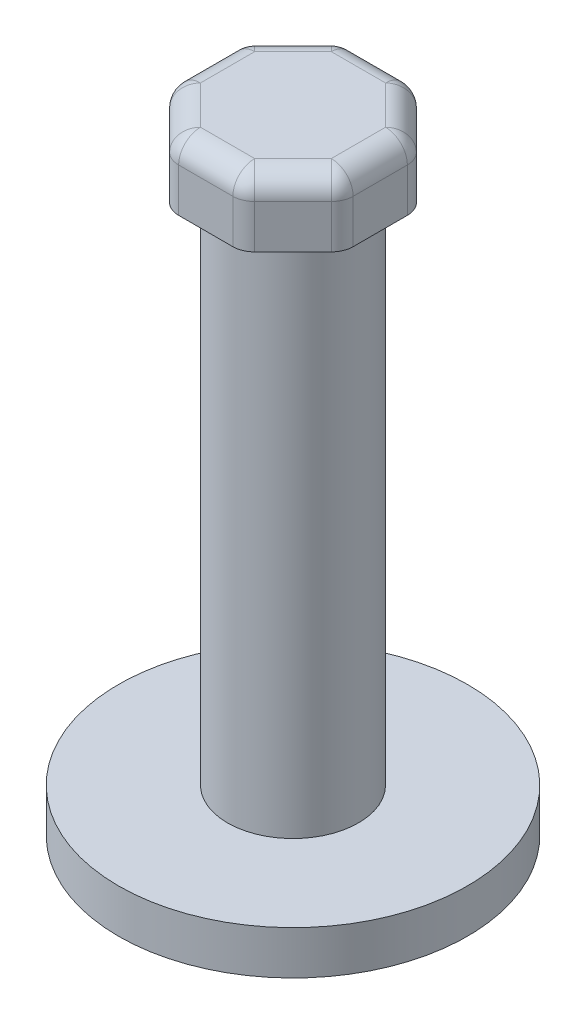
ISO-10303-21;
HEADER;
FILE_DESCRIPTION(('STEP AP214'),'2;1');
FILE_NAME('part.step','',(''),(''),'','','');
FILE_SCHEMA(('AUTOMOTIVE_DESIGN { 1 0 10303 214 1 1 1 1 }'));
ENDSEC;
DATA;
#1=APPLICATION_CONTEXT('core data for automotive mechanical design processes');
#2=APPLICATION_PROTOCOL_DEFINITION('international standard','automotive_design',2000,#1);
#3=PRODUCT_CONTEXT('',#1,'mechanical');
#4=PRODUCT('Part','Part','',(#3));
#5=PRODUCT_RELATED_PRODUCT_CATEGORY('part','',(#4));
#6=PRODUCT_DEFINITION_FORMATION('','',#4);
#7=PRODUCT_DEFINITION_CONTEXT('part definition',#1,'design');
#8=PRODUCT_DEFINITION('design','',#6,#7);
#9=PRODUCT_DEFINITION_SHAPE('','',#8);
#10=(LENGTH_UNIT() NAMED_UNIT(*) SI_UNIT(.MILLI.,.METRE.));
#11=(NAMED_UNIT(*) PLANE_ANGLE_UNIT() SI_UNIT($,.RADIAN.));
#12=(NAMED_UNIT(*) SI_UNIT($,.STERADIAN.) SOLID_ANGLE_UNIT());
#13=UNCERTAINTY_MEASURE_WITH_UNIT(LENGTH_MEASURE(1.E-05),#10,'distance_accuracy_value','');
#14=(GEOMETRIC_REPRESENTATION_CONTEXT(3) GLOBAL_UNCERTAINTY_ASSIGNED_CONTEXT((#13)) GLOBAL_UNIT_ASSIGNED_CONTEXT((#10,
#11,#12)) REPRESENTATION_CONTEXT('',''));
#15=CARTESIAN_POINT('',(0.,0.,0.));
#16=DIRECTION('',(0.,0.,1.));
#17=DIRECTION('',(1.,0.,0.));
#18=AXIS2_PLACEMENT_3D('',#15,#16,#17);
#19=CARTESIAN_POINT('',(0.,2.54,0.));
#20=DIRECTION('',(0.,-1.,0.));
#21=DIRECTION('',(0.,0.,-1.));
#22=AXIS2_PLACEMENT_3D('',#19,#20,#21);
#23=CYLINDRICAL_SURFACE('',#22,10.16);
#24=CARTESIAN_POINT('',(0.,2.54,0.));
#25=DIRECTION('',(0.,1.,0.));
#26=DIRECTION('',(0.,0.,1.));
#27=AXIS2_PLACEMENT_3D('',#24,#25,#26);
#28=CIRCLE('',#27,10.16);
#29=CARTESIAN_POINT('',(0.,2.54,10.16));
#30=VERTEX_POINT('',#29);
#31=EDGE_CURVE('E208',#30,#30,#28,.T.);
#32=ORIENTED_EDGE('',*,*,#31,.F.);
#33=EDGE_LOOP('',(#32));
#34=FACE_BOUND('',#33,.T.);
#35=CARTESIAN_POINT('',(0.,0.,0.));
#36=DIRECTION('',(0.,1.,0.));
#37=DIRECTION('',(0.,0.,1.));
#38=AXIS2_PLACEMENT_3D('',#35,#36,#37);
#39=CIRCLE('',#38,10.16);
#40=CARTESIAN_POINT('',(0.,0.,10.16));
#41=VERTEX_POINT('',#40);
#42=EDGE_CURVE('E211',#41,#41,#39,.T.);
#43=ORIENTED_EDGE('',*,*,#42,.T.);
#44=EDGE_LOOP('',(#43));
#45=FACE_BOUND('',#44,.T.);
#46=ADVANCED_FACE('F33',(#34,#45),#23,.T.);
#47=CARTESIAN_POINT('',(0.,2.54,0.));
#48=DIRECTION('',(0.,1.,0.));
#49=DIRECTION('',(0.,0.,1.));
#50=AXIS2_PLACEMENT_3D('',#47,#48,#49);
#51=PLANE('',#50);
#52=CARTESIAN_POINT('',(0.,2.54,0.));
#53=DIRECTION('',(0.,1.,0.));
#54=DIRECTION('',(0.,0.,1.));
#55=AXIS2_PLACEMENT_3D('',#52,#53,#54);
#56=CIRCLE('',#55,3.81);
#57=CARTESIAN_POINT('',(0.,2.54,3.81));
#58=VERTEX_POINT('',#57);
#59=EDGE_CURVE('E204',#58,#58,#56,.T.);
#60=ORIENTED_EDGE('',*,*,#59,.F.);
#61=EDGE_LOOP('',(#60));
#62=FACE_BOUND('',#61,.T.);
#63=ORIENTED_EDGE('',*,*,#31,.T.);
#64=EDGE_LOOP('',(#63));
#65=FACE_BOUND('',#64,.T.);
#66=ADVANCED_FACE('F399',(#62,#65),#51,.T.);
#67=CARTESIAN_POINT('',(0.,0.,0.));
#68=DIRECTION('',(0.,1.,0.));
#69=DIRECTION('',(0.,0.,1.));
#70=AXIS2_PLACEMENT_3D('',#67,#68,#69);
#71=PLANE('',#70);
#72=ORIENTED_EDGE('',*,*,#42,.F.);
#73=EDGE_LOOP('',(#72));
#74=FACE_BOUND('',#73,.T.);
#75=ADVANCED_FACE('F396',(#74),#71,.F.);
#76=CARTESIAN_POINT('',(0.,33.02,0.));
#77=DIRECTION('',(0.,-1.,0.));
#78=DIRECTION('',(0.,0.,-1.));
#79=AXIS2_PLACEMENT_3D('',#76,#77,#78);
#80=CYLINDRICAL_SURFACE('',#79,3.81);
#81=CARTESIAN_POINT('',(0.,33.02,0.));
#82=DIRECTION('',(0.,1.,0.));
#83=DIRECTION('',(0.,0.,1.));
#84=AXIS2_PLACEMENT_3D('',#81,#82,#83);
#85=CIRCLE('',#84,3.81);
#86=CARTESIAN_POINT('',(0.,33.02,3.81));
#87=VERTEX_POINT('',#86);
#88=EDGE_CURVE('E387',#87,#87,#85,.T.);
#89=ORIENTED_EDGE('',*,*,#88,.F.);
#90=EDGE_LOOP('',(#89));
#91=FACE_BOUND('',#90,.T.);
#92=ORIENTED_EDGE('',*,*,#59,.T.);
#93=EDGE_LOOP('',(#92));
#94=FACE_BOUND('',#93,.T.);
#95=ADVANCED_FACE('F398',(#91,#94),#80,.T.);
#96=CARTESIAN_POINT('',(5.08,36.83,-2.10420489685532));
#97=DIRECTION('',(-0.707106781186547,0.,0.707106781186548));
#98=DIRECTION('',(0.707106781186548,0.,0.707106781186547));
#99=AXIS2_PLACEMENT_3D('',#96,#97,#98);
#100=PLANE('',#99);
#101=DIRECTION('',(-0.707106781186548,0.,-0.707106781186547));
#102=VECTOR('',#101,1.);
#103=CARTESIAN_POINT('',(5.08,35.56,-2.10420489685532));
#104=LINE('',#103,#102);
#105=CARTESIAN_POINT('',(2.4761792847484,35.56,-4.70802561210692));
#106=VERTEX_POINT('',#105);
#107=CARTESIAN_POINT('',(4.70802561210692,35.56,-2.47617928474841));
#108=VERTEX_POINT('',#107);
#109=EDGE_CURVE('E232',#106,#108,#104,.F.);
#110=ORIENTED_EDGE('',*,*,#109,.T.);
#111=DIRECTION('',(0.,-1.,0.));
#112=VECTOR('',#111,1.);
#113=CARTESIAN_POINT('',(4.70802561210692,36.83,-2.47617928474841));
#114=LINE('',#113,#112);
#115=CARTESIAN_POINT('',(4.70802561210692,33.02,-2.47617928474841));
#116=VERTEX_POINT('',#115);
#117=EDGE_CURVE('E234',#108,#116,#114,.T.);
#118=ORIENTED_EDGE('',*,*,#117,.T.);
#119=DIRECTION('',(-0.707106781186548,0.,-0.707106781186547));
#120=VECTOR('',#119,1.);
#121=CARTESIAN_POINT('',(5.08,33.02,-2.10420489685532));
#122=LINE('',#121,#120);
#123=CARTESIAN_POINT('',(2.4761792847484,33.02,-4.70802561210692));
#124=VERTEX_POINT('',#123);
#125=EDGE_CURVE('E367',#116,#124,#122,.T.);
#126=ORIENTED_EDGE('',*,*,#125,.T.);
#127=DIRECTION('',(0.,-1.,0.));
#128=VECTOR('',#127,1.);
#129=CARTESIAN_POINT('',(2.4761792847484,36.83,-4.70802561210692));
#130=LINE('',#129,#128);
#131=EDGE_CURVE('E230',#124,#106,#130,.F.);
#132=ORIENTED_EDGE('',*,*,#131,.T.);
#133=EDGE_LOOP('',(#110,#118,#126,#132));
#134=FACE_BOUND('',#133,.T.);
#135=ADVANCED_FACE('F405',(#134),#100,.F.);
#136=CARTESIAN_POINT('',(2.10420489685532,36.83,-5.08));
#137=DIRECTION('',(0.,0.,1.));
#138=DIRECTION('',(1.,0.,0.));
#139=AXIS2_PLACEMENT_3D('',#136,#137,#138);
#140=PLANE('',#139);
#141=DIRECTION('',(-1.,0.,0.));
#142=VECTOR('',#141,1.);
#143=CARTESIAN_POINT('',(2.10420489685532,35.56,-5.08));
#144=LINE('',#143,#142);
#145=CARTESIAN_POINT('',(-1.57815367264149,35.56,-5.08));
#146=VERTEX_POINT('',#145);
#147=CARTESIAN_POINT('',(1.57815367264149,35.56,-5.08));
#148=VERTEX_POINT('',#147);
#149=EDGE_CURVE('E238',#146,#148,#144,.F.);
#150=ORIENTED_EDGE('',*,*,#149,.T.);
#151=DIRECTION('',(0.,-1.,0.));
#152=VECTOR('',#151,1.);
#153=CARTESIAN_POINT('',(1.57815367264149,36.83,-5.08));
#154=LINE('',#153,#152);
#155=CARTESIAN_POINT('',(1.57815367264149,33.02,-5.08));
#156=VERTEX_POINT('',#155);
#157=EDGE_CURVE('E240',#148,#156,#154,.T.);
#158=ORIENTED_EDGE('',*,*,#157,.T.);
#159=DIRECTION('',(-1.,0.,0.));
#160=VECTOR('',#159,1.);
#161=CARTESIAN_POINT('',(2.10420489685532,33.02,-5.08));
#162=LINE('',#161,#160);
#163=CARTESIAN_POINT('',(-1.57815367264149,33.02,-5.08));
#164=VERTEX_POINT('',#163);
#165=EDGE_CURVE('E361',#156,#164,#162,.T.);
#166=ORIENTED_EDGE('',*,*,#165,.T.);
#167=DIRECTION('',(0.,-1.,0.));
#168=VECTOR('',#167,1.);
#169=CARTESIAN_POINT('',(-1.57815367264149,36.83,-5.08));
#170=LINE('',#169,#168);
#171=EDGE_CURVE('E236',#164,#146,#170,.F.);
#172=ORIENTED_EDGE('',*,*,#171,.T.);
#173=EDGE_LOOP('',(#150,#158,#166,#172));
#174=FACE_BOUND('',#173,.T.);
#175=ADVANCED_FACE('F365',(#174),#140,.F.);
#176=CARTESIAN_POINT('',(-2.10420489685532,36.83,-5.08));
#177=DIRECTION('',(0.707106781186548,0.,0.707106781186547));
#178=DIRECTION('',(0.707106781186547,0.,-0.707106781186548));
#179=AXIS2_PLACEMENT_3D('',#176,#177,#178);
#180=PLANE('',#179);
#181=DIRECTION('',(-0.707106781186547,0.,0.707106781186548));
#182=VECTOR('',#181,1.);
#183=CARTESIAN_POINT('',(-2.10420489685532,33.02,-5.08));
#184=LINE('',#183,#182);
#185=CARTESIAN_POINT('',(-2.47617928474841,33.02,-4.70802561210691));
#186=VERTEX_POINT('',#185);
#187=CARTESIAN_POINT('',(-4.70802561210692,33.02,-2.4761792847484));
#188=VERTEX_POINT('',#187);
#189=EDGE_CURVE('E363',#186,#188,#184,.T.);
#190=ORIENTED_EDGE('',*,*,#189,.T.);
#191=DIRECTION('',(0.,-1.,0.));
#192=VECTOR('',#191,1.);
#193=CARTESIAN_POINT('',(-4.70802561210692,36.83,-2.4761792847484));
#194=LINE('',#193,#192);
#195=CARTESIAN_POINT('',(-4.70802561210692,35.56,-2.4761792847484));
#196=VERTEX_POINT('',#195);
#197=EDGE_CURVE('E246',#188,#196,#194,.F.);
#198=ORIENTED_EDGE('',*,*,#197,.T.);
#199=DIRECTION('',(-0.707106781186547,0.,0.707106781186548));
#200=VECTOR('',#199,1.);
#201=CARTESIAN_POINT('',(-2.10420489685532,35.56,-5.08));
#202=LINE('',#201,#200);
#203=CARTESIAN_POINT('',(-2.47617928474841,35.56,-4.70802561210691));
#204=VERTEX_POINT('',#203);
#205=EDGE_CURVE('E244',#196,#204,#202,.F.);
#206=ORIENTED_EDGE('',*,*,#205,.T.);
#207=DIRECTION('',(0.,-1.,0.));
#208=VECTOR('',#207,1.);
#209=CARTESIAN_POINT('',(-2.47617928474841,36.83,-4.70802561210691));
#210=LINE('',#209,#208);
#211=EDGE_CURVE('E242',#204,#186,#210,.T.);
#212=ORIENTED_EDGE('',*,*,#211,.T.);
#213=EDGE_LOOP('',(#190,#198,#206,#212));
#214=FACE_BOUND('',#213,.T.);
#215=ADVANCED_FACE('F347',(#214),#180,.F.);
#216=CARTESIAN_POINT('',(-5.08,36.83,-2.10420489685532));
#217=DIRECTION('',(1.,0.,0.));
#218=DIRECTION('',(0.,0.,-1.));
#219=AXIS2_PLACEMENT_3D('',#216,#217,#218);
#220=PLANE('',#219);
#221=DIRECTION('',(0.,0.,1.));
#222=VECTOR('',#221,1.);
#223=CARTESIAN_POINT('',(-5.08,33.02,-2.10420489685532));
#224=LINE('',#223,#222);
#225=CARTESIAN_POINT('',(-5.08,33.02,-1.57815367264149));
#226=VERTEX_POINT('',#225);
#227=CARTESIAN_POINT('',(-5.08,33.02,1.57815367264149));
#228=VERTEX_POINT('',#227);
#229=EDGE_CURVE('E369',#226,#228,#224,.T.);
#230=ORIENTED_EDGE('',*,*,#229,.T.);
#231=DIRECTION('',(0.,-1.,0.));
#232=VECTOR('',#231,1.);
#233=CARTESIAN_POINT('',(-5.08,36.83,1.57815367264149));
#234=LINE('',#233,#232);
#235=CARTESIAN_POINT('',(-5.08,35.56,1.57815367264149));
#236=VERTEX_POINT('',#235);
#237=EDGE_CURVE('E251',#228,#236,#234,.F.);
#238=ORIENTED_EDGE('',*,*,#237,.T.);
#239=DIRECTION('',(0.,0.,1.));
#240=VECTOR('',#239,1.);
#241=CARTESIAN_POINT('',(-5.08,35.56,-2.10420489685532));
#242=LINE('',#241,#240);
#243=CARTESIAN_POINT('',(-5.08,35.56,-1.57815367264149));
#244=VERTEX_POINT('',#243);
#245=EDGE_CURVE('E187',#236,#244,#242,.F.);
#246=ORIENTED_EDGE('',*,*,#245,.T.);
#247=DIRECTION('',(0.,-1.,0.));
#248=VECTOR('',#247,1.);
#249=CARTESIAN_POINT('',(-5.08,36.83,-1.57815367264149));
#250=LINE('',#249,#248);
#251=EDGE_CURVE('E248',#244,#226,#250,.T.);
#252=ORIENTED_EDGE('',*,*,#251,.T.);
#253=EDGE_LOOP('',(#230,#238,#246,#252));
#254=FACE_BOUND('',#253,.T.);
#255=ADVANCED_FACE('F510',(#254),#220,.F.);
#256=CARTESIAN_POINT('',(-5.08,36.83,2.10420489685532));
#257=DIRECTION('',(0.707106781186547,0.,-0.707106781186548));
#258=DIRECTION('',(-0.707106781186548,0.,-0.707106781186547));
#259=AXIS2_PLACEMENT_3D('',#256,#257,#258);
#260=PLANE('',#259);
#261=DIRECTION('',(0.707106781186548,0.,0.707106781186547));
#262=VECTOR('',#261,1.);
#263=CARTESIAN_POINT('',(-5.08,33.02,2.10420489685532));
#264=LINE('',#263,#262);
#265=CARTESIAN_POINT('',(-4.70802561210691,33.02,2.47617928474841));
#266=VERTEX_POINT('',#265);
#267=CARTESIAN_POINT('',(-2.4761792847484,33.02,4.70802561210692));
#268=VERTEX_POINT('',#267);
#269=EDGE_CURVE('E376',#266,#268,#264,.T.);
#270=ORIENTED_EDGE('',*,*,#269,.T.);
#271=DIRECTION('',(0.,-1.,0.));
#272=VECTOR('',#271,1.);
#273=CARTESIAN_POINT('',(-2.4761792847484,36.83,4.70802561210691));
#274=LINE('',#273,#272);
#275=CARTESIAN_POINT('',(-2.4761792847484,35.56,4.70802561210692));
#276=VERTEX_POINT('',#275);
#277=EDGE_CURVE('E50',#268,#276,#274,.F.);
#278=ORIENTED_EDGE('',*,*,#277,.T.);
#279=DIRECTION('',(0.707106781186548,0.,0.707106781186547));
#280=VECTOR('',#279,1.);
#281=CARTESIAN_POINT('',(-5.08,35.56,2.10420489685532));
#282=LINE('',#281,#280);
#283=CARTESIAN_POINT('',(-4.70802561210691,35.56,2.47617928474841));
#284=VERTEX_POINT('',#283);
#285=EDGE_CURVE('E54',#276,#284,#282,.F.);
#286=ORIENTED_EDGE('',*,*,#285,.T.);
#287=DIRECTION('',(0.,-1.,0.));
#288=VECTOR('',#287,1.);
#289=CARTESIAN_POINT('',(-4.70802561210691,36.83,2.47617928474841));
#290=LINE('',#289,#288);
#291=EDGE_CURVE('E265',#284,#266,#290,.T.);
#292=ORIENTED_EDGE('',*,*,#291,.T.);
#293=EDGE_LOOP('',(#270,#278,#286,#292));
#294=FACE_BOUND('',#293,.T.);
#295=ADVANCED_FACE('F513',(#294),#260,.F.);
#296=CARTESIAN_POINT('',(-2.10420489685532,36.83,5.08));
#297=DIRECTION('',(0.,0.,-1.));
#298=DIRECTION('',(-1.,0.,0.));
#299=AXIS2_PLACEMENT_3D('',#296,#297,#298);
#300=PLANE('',#299);
#301=DIRECTION('',(1.,0.,0.));
#302=VECTOR('',#301,1.);
#303=CARTESIAN_POINT('',(-2.10420489685532,33.02,5.08));
#304=LINE('',#303,#302);
#305=CARTESIAN_POINT('',(-1.57815367264149,33.02,5.08));
#306=VERTEX_POINT('',#305);
#307=CARTESIAN_POINT('',(1.57815367264149,33.02,5.08));
#308=VERTEX_POINT('',#307);
#309=EDGE_CURVE('E378',#306,#308,#304,.T.);
#310=ORIENTED_EDGE('',*,*,#309,.T.);
#311=DIRECTION('',(0.,-1.,0.));
#312=VECTOR('',#311,1.);
#313=CARTESIAN_POINT('',(1.57815367264149,36.83,5.08));
#314=LINE('',#313,#312);
#315=CARTESIAN_POINT('',(1.57815367264149,35.56,5.08));
#316=VERTEX_POINT('',#315);
#317=EDGE_CURVE('E263',#308,#316,#314,.F.);
#318=ORIENTED_EDGE('',*,*,#317,.T.);
#319=DIRECTION('',(1.,0.,0.));
#320=VECTOR('',#319,1.);
#321=CARTESIAN_POINT('',(-2.10420489685532,35.56,5.08));
#322=LINE('',#321,#320);
#323=CARTESIAN_POINT('',(-1.57815367264149,35.56,5.08));
#324=VERTEX_POINT('',#323);
#325=EDGE_CURVE('E261',#316,#324,#322,.F.);
#326=ORIENTED_EDGE('',*,*,#325,.T.);
#327=DIRECTION('',(0.,-1.,0.));
#328=VECTOR('',#327,1.);
#329=CARTESIAN_POINT('',(-1.57815367264149,36.83,5.08));
#330=LINE('',#329,#328);
#331=EDGE_CURVE('E259',#324,#306,#330,.T.);
#332=ORIENTED_EDGE('',*,*,#331,.T.);
#333=EDGE_LOOP('',(#310,#318,#326,#332));
#334=FACE_BOUND('',#333,.T.);
#335=ADVANCED_FACE('F519',(#334),#300,.F.);
#336=CARTESIAN_POINT('',(2.10420489685532,36.83,5.08));
#337=DIRECTION('',(-0.707106781186548,0.,-0.707106781186547));
#338=DIRECTION('',(-0.707106781186547,0.,0.707106781186548));
#339=AXIS2_PLACEMENT_3D('',#336,#337,#338);
#340=PLANE('',#339);
#341=DIRECTION('',(0.707106781186547,0.,-0.707106781186548));
#342=VECTOR('',#341,1.);
#343=CARTESIAN_POINT('',(2.10420489685532,33.02,5.08));
#344=LINE('',#343,#342);
#345=CARTESIAN_POINT('',(2.47617928474841,33.02,4.70802561210691));
#346=VERTEX_POINT('',#345);
#347=CARTESIAN_POINT('',(4.70802561210692,33.02,2.4761792847484));
#348=VERTEX_POINT('',#347);
#349=EDGE_CURVE('E381',#346,#348,#344,.T.);
#350=ORIENTED_EDGE('',*,*,#349,.T.);
#351=DIRECTION('',(0.,-1.,0.));
#352=VECTOR('',#351,1.);
#353=CARTESIAN_POINT('',(4.70802561210692,36.83,2.4761792847484));
#354=LINE('',#353,#352);
#355=CARTESIAN_POINT('',(4.70802561210692,35.56,2.4761792847484));
#356=VERTEX_POINT('',#355);
#357=EDGE_CURVE('E257',#348,#356,#354,.F.);
#358=ORIENTED_EDGE('',*,*,#357,.T.);
#359=DIRECTION('',(0.707106781186547,0.,-0.707106781186548));
#360=VECTOR('',#359,1.);
#361=CARTESIAN_POINT('',(2.10420489685532,35.56,5.08));
#362=LINE('',#361,#360);
#363=CARTESIAN_POINT('',(2.47617928474841,35.56,4.70802561210691));
#364=VERTEX_POINT('',#363);
#365=EDGE_CURVE('E255',#356,#364,#362,.F.);
#366=ORIENTED_EDGE('',*,*,#365,.T.);
#367=DIRECTION('',(0.,-1.,0.));
#368=VECTOR('',#367,1.);
#369=CARTESIAN_POINT('',(2.47617928474841,36.83,4.70802561210691));
#370=LINE('',#369,#368);
#371=EDGE_CURVE('E253',#364,#346,#370,.T.);
#372=ORIENTED_EDGE('',*,*,#371,.T.);
#373=EDGE_LOOP('',(#350,#358,#366,#372));
#374=FACE_BOUND('',#373,.T.);
#375=ADVANCED_FACE('F553',(#374),#340,.F.);
#376=CARTESIAN_POINT('',(5.08,36.83,2.10420489685532));
#377=DIRECTION('',(-1.,0.,0.));
#378=DIRECTION('',(0.,0.,1.));
#379=AXIS2_PLACEMENT_3D('',#376,#377,#378);
#380=PLANE('',#379);
#381=DIRECTION('',(0.,0.,-1.));
#382=VECTOR('',#381,1.);
#383=CARTESIAN_POINT('',(5.08,35.56,2.10420489685532));
#384=LINE('',#383,#382);
#385=CARTESIAN_POINT('',(5.08,35.56,-1.57815367264149));
#386=VERTEX_POINT('',#385);
#387=CARTESIAN_POINT('',(5.08,35.56,1.57815367264149));
#388=VERTEX_POINT('',#387);
#389=EDGE_CURVE('E225',#386,#388,#384,.F.);
#390=ORIENTED_EDGE('',*,*,#389,.T.);
#391=DIRECTION('',(0.,-1.,0.));
#392=VECTOR('',#391,1.);
#393=CARTESIAN_POINT('',(5.08,36.83,1.57815367264149));
#394=LINE('',#393,#392);
#395=CARTESIAN_POINT('',(5.08,33.02,1.57815367264149));
#396=VERTEX_POINT('',#395);
#397=EDGE_CURVE('E228',#388,#396,#394,.T.);
#398=ORIENTED_EDGE('',*,*,#397,.T.);
#399=DIRECTION('',(0.,0.,-1.));
#400=VECTOR('',#399,1.);
#401=CARTESIAN_POINT('',(5.08,33.02,2.10420489685532));
#402=LINE('',#401,#400);
#403=CARTESIAN_POINT('',(5.08,33.02,-1.57815367264149));
#404=VERTEX_POINT('',#403);
#405=EDGE_CURVE('E384',#396,#404,#402,.T.);
#406=ORIENTED_EDGE('',*,*,#405,.T.);
#407=DIRECTION('',(0.,-1.,0.));
#408=VECTOR('',#407,1.);
#409=CARTESIAN_POINT('',(5.08,36.83,-1.57815367264149));
#410=LINE('',#409,#408);
#411=EDGE_CURVE('E223',#404,#386,#410,.F.);
#412=ORIENTED_EDGE('',*,*,#411,.T.);
#413=EDGE_LOOP('',(#390,#398,#406,#412));
#414=FACE_BOUND('',#413,.T.);
#415=ADVANCED_FACE('F545',(#414),#380,.F.);
#416=CARTESIAN_POINT('',(0.,36.83,0.));
#417=DIRECTION('',(0.,1.,0.));
#418=DIRECTION('',(0.,0.,1.));
#419=AXIS2_PLACEMENT_3D('',#416,#417,#418);
#420=PLANE('',#419);
#421=DIRECTION('',(0.707106781186547,0.,-0.707106781186548));
#422=VECTOR('',#421,1.);
#423=CARTESIAN_POINT('',(4.18197438789309,36.83,1.2061792847484));
#424=LINE('',#423,#422);
#425=CARTESIAN_POINT('',(1.57815367264149,36.83,3.81));
#426=VERTEX_POINT('',#425);
#427=CARTESIAN_POINT('',(3.81,36.83,1.57815367264149));
#428=VERTEX_POINT('',#427);
#429=EDGE_CURVE('E180',#426,#428,#424,.T.);
#430=ORIENTED_EDGE('',*,*,#429,.T.);
#431=DIRECTION('',(0.,0.,-1.));
#432=VECTOR('',#431,1.);
#433=CARTESIAN_POINT('',(3.81,36.83,-2.10420489685532));
#434=LINE('',#433,#432);
#435=CARTESIAN_POINT('',(3.81,36.83,-1.57815367264149));
#436=VERTEX_POINT('',#435);
#437=EDGE_CURVE('E220',#428,#436,#434,.T.);
#438=ORIENTED_EDGE('',*,*,#437,.T.);
#439=DIRECTION('',(-0.707106781186548,0.,-0.707106781186547));
#440=VECTOR('',#439,1.);
#441=CARTESIAN_POINT('',(1.20617928474841,36.83,-4.18197438789308));
#442=LINE('',#441,#440);
#443=CARTESIAN_POINT('',(1.57815367264149,36.83,-3.81));
#444=VERTEX_POINT('',#443);
#445=EDGE_CURVE('E218',#436,#444,#442,.T.);
#446=ORIENTED_EDGE('',*,*,#445,.T.);
#447=DIRECTION('',(-1.,0.,0.));
#448=VECTOR('',#447,1.);
#449=CARTESIAN_POINT('',(-2.10420489685532,36.83,-3.81));
#450=LINE('',#449,#448);
#451=CARTESIAN_POINT('',(-1.57815367264149,36.83,-3.81));
#452=VERTEX_POINT('',#451);
#453=EDGE_CURVE('E216',#444,#452,#450,.T.);
#454=ORIENTED_EDGE('',*,*,#453,.T.);
#455=DIRECTION('',(-0.707106781186547,0.,0.707106781186548));
#456=VECTOR('',#455,1.);
#457=CARTESIAN_POINT('',(-4.18197438789308,36.83,-1.20617928474841));
#458=LINE('',#457,#456);
#459=CARTESIAN_POINT('',(-3.81,36.83,-1.57815367264149));
#460=VERTEX_POINT('',#459);
#461=EDGE_CURVE('E176',#452,#460,#458,.T.);
#462=ORIENTED_EDGE('',*,*,#461,.T.);
#463=DIRECTION('',(0.,0.,1.));
#464=VECTOR('',#463,1.);
#465=CARTESIAN_POINT('',(-3.81,36.83,2.10420489685532));
#466=LINE('',#465,#464);
#467=CARTESIAN_POINT('',(-3.81,36.83,1.57815367264149));
#468=VERTEX_POINT('',#467);
#469=EDGE_CURVE('E169',#460,#468,#466,.T.);
#470=ORIENTED_EDGE('',*,*,#469,.T.);
#471=DIRECTION('',(0.707106781186548,0.,0.707106781186547));
#472=VECTOR('',#471,1.);
#473=CARTESIAN_POINT('',(-1.2061792847484,36.83,4.18197438789308));
#474=LINE('',#473,#472);
#475=CARTESIAN_POINT('',(-1.57815367264149,36.83,3.81));
#476=VERTEX_POINT('',#475);
#477=EDGE_CURVE('E173',#468,#476,#474,.T.);
#478=ORIENTED_EDGE('',*,*,#477,.T.);
#479=DIRECTION('',(1.,0.,0.));
#480=VECTOR('',#479,1.);
#481=CARTESIAN_POINT('',(2.10420489685532,36.83,3.81));
#482=LINE('',#481,#480);
#483=EDGE_CURVE('E203',#476,#426,#482,.T.);
#484=ORIENTED_EDGE('',*,*,#483,.T.);
#485=EDGE_LOOP('',(#430,#438,#446,#454,#462,#470,#478,#484));
#486=FACE_BOUND('',#485,.T.);
#487=ADVANCED_FACE('F171',(#486),#420,.T.);
#488=CARTESIAN_POINT('',(0.,33.02,0.));
#489=DIRECTION('',(0.,1.,0.));
#490=DIRECTION('',(0.,0.,1.));
#491=AXIS2_PLACEMENT_3D('',#488,#489,#490);
#492=PLANE('',#491);
#493=ORIENTED_EDGE('',*,*,#88,.T.);
#494=EDGE_LOOP('',(#493));
#495=FACE_BOUND('',#494,.T.);
#496=ORIENTED_EDGE('',*,*,#405,.F.);
#497=CARTESIAN_POINT('',(3.81,33.02,1.57815367264149));
#498=DIRECTION('',(0.,1.,0.));
#499=DIRECTION('',(0.,0.,1.));
#500=AXIS2_PLACEMENT_3D('',#497,#498,#499);
#501=CIRCLE('',#500,1.27);
#502=EDGE_CURVE('E11',#396,#348,#501,.F.);
#503=ORIENTED_EDGE('',*,*,#502,.T.);
#504=ORIENTED_EDGE('',*,*,#349,.F.);
#505=CARTESIAN_POINT('',(1.57815367264149,33.02,3.81));
#506=DIRECTION('',(0.,1.,0.));
#507=DIRECTION('',(0.,0.,1.));
#508=AXIS2_PLACEMENT_3D('',#505,#506,#507);
#509=CIRCLE('',#508,1.27);
#510=EDGE_CURVE('E42',#346,#308,#509,.F.);
#511=ORIENTED_EDGE('',*,*,#510,.T.);
#512=ORIENTED_EDGE('',*,*,#309,.F.);
#513=CARTESIAN_POINT('',(-1.57815367264149,33.02,3.81));
#514=DIRECTION('',(0.,1.,0.));
#515=DIRECTION('',(0.,0.,1.));
#516=AXIS2_PLACEMENT_3D('',#513,#514,#515);
#517=CIRCLE('',#516,1.27);
#518=EDGE_CURVE('E279',#306,#268,#517,.F.);
#519=ORIENTED_EDGE('',*,*,#518,.T.);
#520=ORIENTED_EDGE('',*,*,#269,.F.);
#521=CARTESIAN_POINT('',(-3.81,33.02,1.57815367264149));
#522=DIRECTION('',(0.,1.,0.));
#523=DIRECTION('',(0.,0.,1.));
#524=AXIS2_PLACEMENT_3D('',#521,#522,#523);
#525=CIRCLE('',#524,1.27);
#526=EDGE_CURVE('E273',#266,#228,#525,.F.);
#527=ORIENTED_EDGE('',*,*,#526,.T.);
#528=ORIENTED_EDGE('',*,*,#229,.F.);
#529=CARTESIAN_POINT('',(-3.81,33.02,-1.57815367264149));
#530=DIRECTION('',(0.,1.,0.));
#531=DIRECTION('',(0.,0.,1.));
#532=AXIS2_PLACEMENT_3D('',#529,#530,#531);
#533=CIRCLE('',#532,1.27);
#534=EDGE_CURVE('E271',#226,#188,#533,.F.);
#535=ORIENTED_EDGE('',*,*,#534,.T.);
#536=ORIENTED_EDGE('',*,*,#189,.F.);
#537=CARTESIAN_POINT('',(-1.57815367264149,33.02,-3.81));
#538=DIRECTION('',(0.,1.,0.));
#539=DIRECTION('',(0.,0.,1.));
#540=AXIS2_PLACEMENT_3D('',#537,#538,#539);
#541=CIRCLE('',#540,1.27);
#542=EDGE_CURVE('E269',#186,#164,#541,.F.);
#543=ORIENTED_EDGE('',*,*,#542,.T.);
#544=ORIENTED_EDGE('',*,*,#165,.F.);
#545=CARTESIAN_POINT('',(1.57815367264149,33.02,-3.81));
#546=DIRECTION('',(0.,1.,0.));
#547=DIRECTION('',(0.,0.,1.));
#548=AXIS2_PLACEMENT_3D('',#545,#546,#547);
#549=CIRCLE('',#548,1.27);
#550=EDGE_CURVE('E275',#156,#124,#549,.F.);
#551=ORIENTED_EDGE('',*,*,#550,.T.);
#552=ORIENTED_EDGE('',*,*,#125,.F.);
#553=CARTESIAN_POINT('',(3.81,33.02,-1.57815367264149));
#554=DIRECTION('',(0.,1.,0.));
#555=DIRECTION('',(0.,0.,1.));
#556=AXIS2_PLACEMENT_3D('',#553,#554,#555);
#557=CIRCLE('',#556,1.27);
#558=EDGE_CURVE('E277',#116,#404,#557,.F.);
#559=ORIENTED_EDGE('',*,*,#558,.T.);
#560=EDGE_LOOP('',(#496,#503,#504,#511,#512,#519,#520,#527,#528,#535,#536,#543,#544,#551,#552,#559));
#561=FACE_BOUND('',#560,.T.);
#562=ADVANCED_FACE('F360',(#495,#561),#492,.F.);
#563=CARTESIAN_POINT('',(-3.81,36.83,1.57815367264149));
#564=DIRECTION('',(0.,-1.,0.));
#565=DIRECTION('',(0.,0.,-1.));
#566=AXIS2_PLACEMENT_3D('',#563,#564,#565);
#567=CYLINDRICAL_SURFACE('',#566,1.27);
#568=ORIENTED_EDGE('',*,*,#526,.F.);
#569=ORIENTED_EDGE('',*,*,#291,.F.);
#570=CARTESIAN_POINT('',(-3.81,35.56,1.57815367264149));
#571=DIRECTION('',(0.,1.,0.));
#572=DIRECTION('',(0.,0.,1.));
#573=AXIS2_PLACEMENT_3D('',#570,#571,#572);
#574=CIRCLE('',#573,1.27);
#575=EDGE_CURVE('E37',#236,#284,#574,.T.);
#576=ORIENTED_EDGE('',*,*,#575,.F.);
#577=ORIENTED_EDGE('',*,*,#237,.F.);
#578=EDGE_LOOP('',(#568,#569,#576,#577));
#579=FACE_BOUND('',#578,.T.);
#580=ADVANCED_FACE('F35',(#579),#567,.T.);
#581=CARTESIAN_POINT('',(-3.81,35.56,0.));
#582=DIRECTION('',(0.,0.,-1.));
#583=DIRECTION('',(-1.,0.,0.));
#584=AXIS2_PLACEMENT_3D('',#581,#582,#583);
#585=CYLINDRICAL_SURFACE('',#584,1.27);
#586=CARTESIAN_POINT('',(-3.81,35.56,-1.57815367264149));
#587=DIRECTION('',(0.,0.,-1.));
#588=DIRECTION('',(-1.,0.,0.));
#589=AXIS2_PLACEMENT_3D('',#586,#587,#588);
#590=CIRCLE('',#589,1.27);
#591=EDGE_CURVE('E191',#244,#460,#590,.T.);
#592=ORIENTED_EDGE('',*,*,#591,.F.);
#593=ORIENTED_EDGE('',*,*,#245,.F.);
#594=CARTESIAN_POINT('',(-3.81,35.56,1.57815367264149));
#595=DIRECTION('',(0.,0.,1.));
#596=DIRECTION('',(1.,0.,0.));
#597=AXIS2_PLACEMENT_3D('',#594,#595,#596);
#598=CIRCLE('',#597,1.27);
#599=EDGE_CURVE('E184',#468,#236,#598,.T.);
#600=ORIENTED_EDGE('',*,*,#599,.F.);
#601=ORIENTED_EDGE('',*,*,#469,.F.);
#602=EDGE_LOOP('',(#592,#593,#600,#601));
#603=FACE_BOUND('',#602,.T.);
#604=ADVANCED_FACE('F186',(#603),#585,.T.);
#605=CARTESIAN_POINT('',(-3.81,36.83,-1.57815367264149));
#606=DIRECTION('',(0.,-1.,0.));
#607=DIRECTION('',(0.,0.,-1.));
#608=AXIS2_PLACEMENT_3D('',#605,#606,#607);
#609=CYLINDRICAL_SURFACE('',#608,1.27);
#610=ORIENTED_EDGE('',*,*,#534,.F.);
#611=ORIENTED_EDGE('',*,*,#251,.F.);
#612=CARTESIAN_POINT('',(-3.81,35.56,-1.57815367264149));
#613=DIRECTION('',(0.,1.,0.));
#614=DIRECTION('',(0.,0.,1.));
#615=AXIS2_PLACEMENT_3D('',#612,#613,#614);
#616=CIRCLE('',#615,1.27);
#617=EDGE_CURVE('E196',#196,#244,#616,.T.);
#618=ORIENTED_EDGE('',*,*,#617,.F.);
#619=ORIENTED_EDGE('',*,*,#197,.F.);
#620=EDGE_LOOP('',(#610,#611,#618,#619));
#621=FACE_BOUND('',#620,.T.);
#622=ADVANCED_FACE('F491',(#621),#609,.T.);
#623=CARTESIAN_POINT('',(-3.81,35.56,1.57815367264149));
#624=DIRECTION('',(0.,0.,1.));
#625=DIRECTION('',(1.,0.,0.));
#626=AXIS2_PLACEMENT_3D('',#623,#624,#625);
#627=SPHERICAL_SURFACE('',#626,1.27);
#628=ORIENTED_EDGE('',*,*,#599,.T.);
#629=ORIENTED_EDGE('',*,*,#575,.T.);
#630=CARTESIAN_POINT('',(-3.81,35.56,1.57815367264149));
#631=DIRECTION('',(-0.707106781186548,0.,-0.707106781186547));
#632=DIRECTION('',(-0.707106781186547,0.,0.707106781186548));
#633=AXIS2_PLACEMENT_3D('',#630,#631,#632);
#634=CIRCLE('',#633,1.27);
#635=EDGE_CURVE('E193',#468,#284,#634,.F.);
#636=ORIENTED_EDGE('',*,*,#635,.F.);
#637=EDGE_LOOP('',(#628,#629,#636));
#638=FACE_BOUND('',#637,.T.);
#639=ADVANCED_FACE('F194',(#638),#627,.T.);
#640=CARTESIAN_POINT('',(-3.81,35.56,-1.57815367264149));
#641=DIRECTION('',(0.,0.,1.));
#642=DIRECTION('',(1.,0.,0.));
#643=AXIS2_PLACEMENT_3D('',#640,#641,#642);
#644=SPHERICAL_SURFACE('',#643,1.27);
#645=ORIENTED_EDGE('',*,*,#617,.T.);
#646=ORIENTED_EDGE('',*,*,#591,.T.);
#647=CARTESIAN_POINT('',(-3.81,35.56,-1.57815367264149));
#648=DIRECTION('',(-0.707106781186547,0.,0.707106781186548));
#649=DIRECTION('',(0.707106781186548,0.,0.707106781186547));
#650=AXIS2_PLACEMENT_3D('',#647,#648,#649);
#651=CIRCLE('',#650,1.27);
#652=EDGE_CURVE('E197',#196,#460,#651,.F.);
#653=ORIENTED_EDGE('',*,*,#652,.F.);
#654=EDGE_LOOP('',(#645,#646,#653));
#655=FACE_BOUND('',#654,.T.);
#656=ADVANCED_FACE('F338',(#655),#644,.T.);
#657=CARTESIAN_POINT('',(-1.57815367264149,36.83,3.81));
#658=DIRECTION('',(0.,-1.,0.));
#659=DIRECTION('',(0.,0.,-1.));
#660=AXIS2_PLACEMENT_3D('',#657,#658,#659);
#661=CYLINDRICAL_SURFACE('',#660,1.27);
#662=ORIENTED_EDGE('',*,*,#518,.F.);
#663=ORIENTED_EDGE('',*,*,#331,.F.);
#664=CARTESIAN_POINT('',(-1.57815367264149,35.56,3.81));
#665=DIRECTION('',(0.,1.,0.));
#666=DIRECTION('',(0.,0.,1.));
#667=AXIS2_PLACEMENT_3D('',#664,#665,#666);
#668=CIRCLE('',#667,1.27);
#669=EDGE_CURVE('E329',#276,#324,#668,.T.);
#670=ORIENTED_EDGE('',*,*,#669,.F.);
#671=ORIENTED_EDGE('',*,*,#277,.F.);
#672=EDGE_LOOP('',(#662,#663,#670,#671));
#673=FACE_BOUND('',#672,.T.);
#674=ADVANCED_FACE('F483',(#673),#661,.T.);
#675=CARTESIAN_POINT('',(-2.69407683632074,35.56,2.69407683632075));
#676=DIRECTION('',(-0.707106781186548,0.,-0.707106781186547));
#677=DIRECTION('',(-0.707106781186547,0.,0.707106781186548));
#678=AXIS2_PLACEMENT_3D('',#675,#676,#677);
#679=CYLINDRICAL_SURFACE('',#678,1.27);
#680=ORIENTED_EDGE('',*,*,#635,.T.);
#681=ORIENTED_EDGE('',*,*,#285,.F.);
#682=CARTESIAN_POINT('',(-1.57815367264149,35.56,3.81));
#683=DIRECTION('',(0.707106781186548,0.,0.707106781186547));
#684=DIRECTION('',(0.707106781186547,0.,-0.707106781186548));
#685=AXIS2_PLACEMENT_3D('',#682,#683,#684);
#686=CIRCLE('',#685,1.27);
#687=EDGE_CURVE('E201',#476,#276,#686,.T.);
#688=ORIENTED_EDGE('',*,*,#687,.F.);
#689=ORIENTED_EDGE('',*,*,#477,.F.);
#690=EDGE_LOOP('',(#680,#681,#688,#689));
#691=FACE_BOUND('',#690,.T.);
#692=ADVANCED_FACE('F199',(#691),#679,.T.);
#693=CARTESIAN_POINT('',(-2.69407683632075,35.56,-2.69407683632074));
#694=DIRECTION('',(0.707106781186547,0.,-0.707106781186548));
#695=DIRECTION('',(-0.707106781186548,0.,-0.707106781186547));
#696=AXIS2_PLACEMENT_3D('',#693,#694,#695);
#697=CYLINDRICAL_SURFACE('',#696,1.27);
#698=ORIENTED_EDGE('',*,*,#652,.T.);
#699=ORIENTED_EDGE('',*,*,#461,.F.);
#700=CARTESIAN_POINT('',(-1.57815367264149,35.56,-3.81));
#701=DIRECTION('',(0.707106781186547,0.,-0.707106781186548));
#702=DIRECTION('',(-0.707106781186548,0.,-0.707106781186547));
#703=AXIS2_PLACEMENT_3D('',#700,#701,#702);
#704=CIRCLE('',#703,1.27);
#705=EDGE_CURVE('E325',#204,#452,#704,.T.);
#706=ORIENTED_EDGE('',*,*,#705,.F.);
#707=ORIENTED_EDGE('',*,*,#205,.F.);
#708=EDGE_LOOP('',(#698,#699,#706,#707));
#709=FACE_BOUND('',#708,.T.);
#710=ADVANCED_FACE('F342',(#709),#697,.T.);
#711=CARTESIAN_POINT('',(-1.57815367264149,36.83,-3.81));
#712=DIRECTION('',(0.,-1.,0.));
#713=DIRECTION('',(0.,0.,-1.));
#714=AXIS2_PLACEMENT_3D('',#711,#712,#713);
#715=CYLINDRICAL_SURFACE('',#714,1.27);
#716=ORIENTED_EDGE('',*,*,#542,.F.);
#717=ORIENTED_EDGE('',*,*,#211,.F.);
#718=CARTESIAN_POINT('',(-1.57815367264149,35.56,-3.81));
#719=DIRECTION('',(0.,1.,0.));
#720=DIRECTION('',(0.,0.,1.));
#721=AXIS2_PLACEMENT_3D('',#718,#719,#720);
#722=CIRCLE('',#721,1.27);
#723=EDGE_CURVE('E322',#146,#204,#722,.T.);
#724=ORIENTED_EDGE('',*,*,#723,.F.);
#725=ORIENTED_EDGE('',*,*,#171,.F.);
#726=EDGE_LOOP('',(#716,#717,#724,#725));
#727=FACE_BOUND('',#726,.T.);
#728=ADVANCED_FACE('F353',(#727),#715,.T.);
#729=CARTESIAN_POINT('',(-1.57815367264149,35.56,3.81));
#730=DIRECTION('',(0.,0.,1.));
#731=DIRECTION('',(1.,0.,0.));
#732=AXIS2_PLACEMENT_3D('',#729,#730,#731);
#733=SPHERICAL_SURFACE('',#732,1.27);
#734=ORIENTED_EDGE('',*,*,#687,.T.);
#735=ORIENTED_EDGE('',*,*,#669,.T.);
#736=CARTESIAN_POINT('',(-1.57815367264149,35.56,3.81));
#737=DIRECTION('',(-1.,0.,0.));
#738=DIRECTION('',(0.,-1.,0.));
#739=AXIS2_PLACEMENT_3D('',#736,#737,#738);
#740=CIRCLE('',#739,1.27);
#741=EDGE_CURVE('E319',#476,#324,#740,.F.);
#742=ORIENTED_EDGE('',*,*,#741,.F.);
#743=EDGE_LOOP('',(#734,#735,#742));
#744=FACE_BOUND('',#743,.T.);
#745=ADVANCED_FACE('F472',(#744),#733,.T.);
#746=CARTESIAN_POINT('',(-1.57815367264149,35.56,-3.81));
#747=DIRECTION('',(0.,0.,1.));
#748=DIRECTION('',(1.,0.,0.));
#749=AXIS2_PLACEMENT_3D('',#746,#747,#748);
#750=SPHERICAL_SURFACE('',#749,1.27);
#751=ORIENTED_EDGE('',*,*,#723,.T.);
#752=ORIENTED_EDGE('',*,*,#705,.T.);
#753=CARTESIAN_POINT('',(-1.57815367264149,35.56,-3.81));
#754=DIRECTION('',(-1.,0.,0.));
#755=DIRECTION('',(0.,0.,1.));
#756=AXIS2_PLACEMENT_3D('',#753,#754,#755);
#757=CIRCLE('',#756,1.27);
#758=EDGE_CURVE('E316',#146,#452,#757,.F.);
#759=ORIENTED_EDGE('',*,*,#758,.F.);
#760=EDGE_LOOP('',(#751,#752,#759));
#761=FACE_BOUND('',#760,.T.);
#762=ADVANCED_FACE('F468',(#761),#750,.T.);
#763=CARTESIAN_POINT('',(1.57815367264149,36.83,3.81));
#764=DIRECTION('',(0.,-1.,0.));
#765=DIRECTION('',(0.,0.,-1.));
#766=AXIS2_PLACEMENT_3D('',#763,#764,#765);
#767=CYLINDRICAL_SURFACE('',#766,1.27);
#768=ORIENTED_EDGE('',*,*,#510,.F.);
#769=ORIENTED_EDGE('',*,*,#371,.F.);
#770=CARTESIAN_POINT('',(1.57815367264149,35.56,3.81));
#771=DIRECTION('',(0.,1.,0.));
#772=DIRECTION('',(0.,0.,1.));
#773=AXIS2_PLACEMENT_3D('',#770,#771,#772);
#774=CIRCLE('',#773,1.27);
#775=EDGE_CURVE('E313',#316,#364,#774,.T.);
#776=ORIENTED_EDGE('',*,*,#775,.F.);
#777=ORIENTED_EDGE('',*,*,#317,.F.);
#778=EDGE_LOOP('',(#768,#769,#776,#777));
#779=FACE_BOUND('',#778,.T.);
#780=ADVANCED_FACE('F464',(#779),#767,.T.);
#781=CARTESIAN_POINT('',(0.,35.56,3.81));
#782=DIRECTION('',(-1.,0.,0.));
#783=DIRECTION('',(0.,0.,1.));
#784=AXIS2_PLACEMENT_3D('',#781,#782,#783);
#785=CYLINDRICAL_SURFACE('',#784,1.27);
#786=ORIENTED_EDGE('',*,*,#741,.T.);
#787=ORIENTED_EDGE('',*,*,#325,.F.);
#788=CARTESIAN_POINT('',(1.57815367264149,35.56,3.81));
#789=DIRECTION('',(1.,0.,0.));
#790=DIRECTION('',(0.,0.,-1.));
#791=AXIS2_PLACEMENT_3D('',#788,#789,#790);
#792=CIRCLE('',#791,1.27);
#793=EDGE_CURVE('E310',#426,#316,#792,.T.);
#794=ORIENTED_EDGE('',*,*,#793,.F.);
#795=ORIENTED_EDGE('',*,*,#483,.F.);
#796=EDGE_LOOP('',(#786,#787,#794,#795));
#797=FACE_BOUND('',#796,.T.);
#798=ADVANCED_FACE('F460',(#797),#785,.T.);
#799=CARTESIAN_POINT('',(0.,35.56,-3.81));
#800=DIRECTION('',(1.,0.,0.));
#801=DIRECTION('',(0.,0.,-1.));
#802=AXIS2_PLACEMENT_3D('',#799,#800,#801);
#803=CYLINDRICAL_SURFACE('',#802,1.27);
#804=ORIENTED_EDGE('',*,*,#758,.T.);
#805=ORIENTED_EDGE('',*,*,#453,.F.);
#806=CARTESIAN_POINT('',(1.57815367264149,35.56,-3.81));
#807=DIRECTION('',(1.,0.,0.));
#808=DIRECTION('',(0.,1.,0.));
#809=AXIS2_PLACEMENT_3D('',#806,#807,#808);
#810=CIRCLE('',#809,1.27);
#811=EDGE_CURVE('E307',#148,#444,#810,.T.);
#812=ORIENTED_EDGE('',*,*,#811,.F.);
#813=ORIENTED_EDGE('',*,*,#149,.F.);
#814=EDGE_LOOP('',(#804,#805,#812,#813));
#815=FACE_BOUND('',#814,.T.);
#816=ADVANCED_FACE('F456',(#815),#803,.T.);
#817=CARTESIAN_POINT('',(1.57815367264149,36.83,-3.81));
#818=DIRECTION('',(0.,-1.,0.));
#819=DIRECTION('',(0.,0.,-1.));
#820=AXIS2_PLACEMENT_3D('',#817,#818,#819);
#821=CYLINDRICAL_SURFACE('',#820,1.27);
#822=ORIENTED_EDGE('',*,*,#550,.F.);
#823=ORIENTED_EDGE('',*,*,#157,.F.);
#824=CARTESIAN_POINT('',(1.57815367264149,35.56,-3.81));
#825=DIRECTION('',(0.,1.,0.));
#826=DIRECTION('',(0.,0.,1.));
#827=AXIS2_PLACEMENT_3D('',#824,#825,#826);
#828=CIRCLE('',#827,1.27);
#829=EDGE_CURVE('E304',#106,#148,#828,.T.);
#830=ORIENTED_EDGE('',*,*,#829,.F.);
#831=ORIENTED_EDGE('',*,*,#131,.F.);
#832=EDGE_LOOP('',(#822,#823,#830,#831));
#833=FACE_BOUND('',#832,.T.);
#834=ADVANCED_FACE('F452',(#833),#821,.T.);
#835=CARTESIAN_POINT('',(1.57815367264149,35.56,3.81));
#836=DIRECTION('',(0.,0.,1.));
#837=DIRECTION('',(1.,0.,0.));
#838=AXIS2_PLACEMENT_3D('',#835,#836,#837);
#839=SPHERICAL_SURFACE('',#838,1.27);
#840=ORIENTED_EDGE('',*,*,#793,.T.);
#841=ORIENTED_EDGE('',*,*,#775,.T.);
#842=CARTESIAN_POINT('',(1.57815367264149,35.56,3.81));
#843=DIRECTION('',(-0.707106781186547,0.,0.707106781186548));
#844=DIRECTION('',(0.707106781186548,0.,0.707106781186547));
#845=AXIS2_PLACEMENT_3D('',#842,#843,#844);
#846=CIRCLE('',#845,1.27);
#847=EDGE_CURVE('E301',#426,#364,#846,.F.);
#848=ORIENTED_EDGE('',*,*,#847,.F.);
#849=EDGE_LOOP('',(#840,#841,#848));
#850=FACE_BOUND('',#849,.T.);
#851=ADVANCED_FACE('F448',(#850),#839,.T.);
#852=CARTESIAN_POINT('',(1.57815367264149,35.56,-3.81));
#853=DIRECTION('',(0.,0.,1.));
#854=DIRECTION('',(1.,0.,0.));
#855=AXIS2_PLACEMENT_3D('',#852,#853,#854);
#856=SPHERICAL_SURFACE('',#855,1.27);
#857=ORIENTED_EDGE('',*,*,#829,.T.);
#858=ORIENTED_EDGE('',*,*,#811,.T.);
#859=CARTESIAN_POINT('',(1.57815367264149,35.56,-3.81));
#860=DIRECTION('',(-0.707106781186548,0.,-0.707106781186547));
#861=DIRECTION('',(-0.707106781186547,0.,0.707106781186548));
#862=AXIS2_PLACEMENT_3D('',#859,#860,#861);
#863=CIRCLE('',#862,1.27);
#864=EDGE_CURVE('E298',#106,#444,#863,.F.);
#865=ORIENTED_EDGE('',*,*,#864,.F.);
#866=EDGE_LOOP('',(#857,#858,#865));
#867=FACE_BOUND('',#866,.T.);
#868=ADVANCED_FACE('F444',(#867),#856,.T.);
#869=CARTESIAN_POINT('',(3.81,36.83,1.57815367264149));
#870=DIRECTION('',(0.,-1.,0.));
#871=DIRECTION('',(0.,0.,-1.));
#872=AXIS2_PLACEMENT_3D('',#869,#870,#871);
#873=CYLINDRICAL_SURFACE('',#872,1.27);
#874=ORIENTED_EDGE('',*,*,#502,.F.);
#875=ORIENTED_EDGE('',*,*,#397,.F.);
#876=CARTESIAN_POINT('',(3.81,35.56,1.57815367264149));
#877=DIRECTION('',(0.,1.,0.));
#878=DIRECTION('',(0.,0.,1.));
#879=AXIS2_PLACEMENT_3D('',#876,#877,#878);
#880=CIRCLE('',#879,1.27);
#881=EDGE_CURVE('E295',#356,#388,#880,.T.);
#882=ORIENTED_EDGE('',*,*,#881,.F.);
#883=ORIENTED_EDGE('',*,*,#357,.F.);
#884=EDGE_LOOP('',(#874,#875,#882,#883));
#885=FACE_BOUND('',#884,.T.);
#886=ADVANCED_FACE('F440',(#885),#873,.T.);
#887=CARTESIAN_POINT('',(2.69407683632075,35.56,2.69407683632075));
#888=DIRECTION('',(-0.707106781186547,0.,0.707106781186548));
#889=DIRECTION('',(0.707106781186548,0.,0.707106781186547));
#890=AXIS2_PLACEMENT_3D('',#887,#888,#889);
#891=CYLINDRICAL_SURFACE('',#890,1.27);
#892=ORIENTED_EDGE('',*,*,#847,.T.);
#893=ORIENTED_EDGE('',*,*,#365,.F.);
#894=CARTESIAN_POINT('',(3.81,35.56,1.57815367264149));
#895=DIRECTION('',(0.707106781186548,0.,-0.707106781186547));
#896=DIRECTION('',(-0.707106781186547,0.,-0.707106781186548));
#897=AXIS2_PLACEMENT_3D('',#894,#895,#896);
#898=CIRCLE('',#897,1.27);
#899=EDGE_CURVE('E292',#428,#356,#898,.T.);
#900=ORIENTED_EDGE('',*,*,#899,.F.);
#901=ORIENTED_EDGE('',*,*,#429,.F.);
#902=EDGE_LOOP('',(#892,#893,#900,#901));
#903=FACE_BOUND('',#902,.T.);
#904=ADVANCED_FACE('F436',(#903),#891,.T.);
#905=CARTESIAN_POINT('',(2.69407683632075,35.56,-2.69407683632075));
#906=DIRECTION('',(0.707106781186548,0.,0.707106781186547));
#907=DIRECTION('',(0.707106781186547,0.,-0.707106781186548));
#908=AXIS2_PLACEMENT_3D('',#905,#906,#907);
#909=CYLINDRICAL_SURFACE('',#908,1.27);
#910=ORIENTED_EDGE('',*,*,#864,.T.);
#911=ORIENTED_EDGE('',*,*,#445,.F.);
#912=CARTESIAN_POINT('',(3.81,35.56,-1.57815367264149));
#913=DIRECTION('',(0.707106781186548,0.,0.707106781186547));
#914=DIRECTION('',(0.707106781186547,0.,-0.707106781186548));
#915=AXIS2_PLACEMENT_3D('',#912,#913,#914);
#916=CIRCLE('',#915,1.27);
#917=EDGE_CURVE('E289',#108,#436,#916,.T.);
#918=ORIENTED_EDGE('',*,*,#917,.F.);
#919=ORIENTED_EDGE('',*,*,#109,.F.);
#920=EDGE_LOOP('',(#910,#911,#918,#919));
#921=FACE_BOUND('',#920,.T.);
#922=ADVANCED_FACE('F432',(#921),#909,.T.);
#923=CARTESIAN_POINT('',(3.81,36.83,-1.57815367264149));
#924=DIRECTION('',(0.,-1.,0.));
#925=DIRECTION('',(0.,0.,-1.));
#926=AXIS2_PLACEMENT_3D('',#923,#924,#925);
#927=CYLINDRICAL_SURFACE('',#926,1.27);
#928=ORIENTED_EDGE('',*,*,#558,.F.);
#929=ORIENTED_EDGE('',*,*,#117,.F.);
#930=CARTESIAN_POINT('',(3.81,35.56,-1.57815367264149));
#931=DIRECTION('',(0.,1.,0.));
#932=DIRECTION('',(0.,0.,1.));
#933=AXIS2_PLACEMENT_3D('',#930,#931,#932);
#934=CIRCLE('',#933,1.27);
#935=EDGE_CURVE('E286',#386,#108,#934,.T.);
#936=ORIENTED_EDGE('',*,*,#935,.F.);
#937=ORIENTED_EDGE('',*,*,#411,.F.);
#938=EDGE_LOOP('',(#928,#929,#936,#937));
#939=FACE_BOUND('',#938,.T.);
#940=ADVANCED_FACE('F428',(#939),#927,.T.);
#941=CARTESIAN_POINT('',(3.81,35.56,1.57815367264149));
#942=DIRECTION('',(0.,0.,1.));
#943=DIRECTION('',(1.,0.,0.));
#944=AXIS2_PLACEMENT_3D('',#941,#942,#943);
#945=SPHERICAL_SURFACE('',#944,1.27);
#946=ORIENTED_EDGE('',*,*,#899,.T.);
#947=ORIENTED_EDGE('',*,*,#881,.T.);
#948=CARTESIAN_POINT('',(3.81,35.56,1.57815367264149));
#949=DIRECTION('',(0.,0.,1.));
#950=DIRECTION('',(1.,0.,0.));
#951=AXIS2_PLACEMENT_3D('',#948,#949,#950);
#952=CIRCLE('',#951,1.27);
#953=EDGE_CURVE('E284',#428,#388,#952,.F.);
#954=ORIENTED_EDGE('',*,*,#953,.F.);
#955=EDGE_LOOP('',(#946,#947,#954));
#956=FACE_BOUND('',#955,.T.);
#957=ADVANCED_FACE('F424',(#956),#945,.T.);
#958=CARTESIAN_POINT('',(3.81,35.56,-1.57815367264149));
#959=DIRECTION('',(0.,0.,1.));
#960=DIRECTION('',(1.,0.,0.));
#961=AXIS2_PLACEMENT_3D('',#958,#959,#960);
#962=SPHERICAL_SURFACE('',#961,1.27);
#963=ORIENTED_EDGE('',*,*,#935,.T.);
#964=ORIENTED_EDGE('',*,*,#917,.T.);
#965=CARTESIAN_POINT('',(3.81,35.56,-1.57815367264149));
#966=DIRECTION('',(0.,0.,-1.));
#967=DIRECTION('',(-1.,0.,0.));
#968=AXIS2_PLACEMENT_3D('',#965,#966,#967);
#969=CIRCLE('',#968,1.27);
#970=EDGE_CURVE('E282',#386,#436,#969,.F.);
#971=ORIENTED_EDGE('',*,*,#970,.F.);
#972=EDGE_LOOP('',(#963,#964,#971));
#973=FACE_BOUND('',#972,.T.);
#974=ADVANCED_FACE('F420',(#973),#962,.T.);
#975=CARTESIAN_POINT('',(3.81,35.56,0.));
#976=DIRECTION('',(0.,0.,1.));
#977=DIRECTION('',(1.,0.,0.));
#978=AXIS2_PLACEMENT_3D('',#975,#976,#977);
#979=CYLINDRICAL_SURFACE('',#978,1.27);
#980=ORIENTED_EDGE('',*,*,#953,.T.);
#981=ORIENTED_EDGE('',*,*,#389,.F.);
#982=ORIENTED_EDGE('',*,*,#970,.T.);
#983=ORIENTED_EDGE('',*,*,#437,.F.);
#984=EDGE_LOOP('',(#980,#981,#982,#983));
#985=FACE_BOUND('',#984,.T.);
#986=ADVANCED_FACE('F417',(#985),#979,.T.);
#987=CLOSED_SHELL('',(#46,#66,#75,#95,#135,#175,#215,#255,#295,#335,#375,#415,#487,#562,#580,
#604,#622,#639,#656,#674,#692,#710,#728,#745,#762,#780,#798,#816,#834,#851,#868,#886,#904,#922,
#940,#957,#974,#986));
#988=MANIFOLD_SOLID_BREP('B2',#987);
#989=ADVANCED_BREP_SHAPE_REPRESENTATION('',(#18,#988),#14);
#990=SHAPE_DEFINITION_REPRESENTATION(#9,#989);
ENDSEC;
END-ISO-10303-21;
